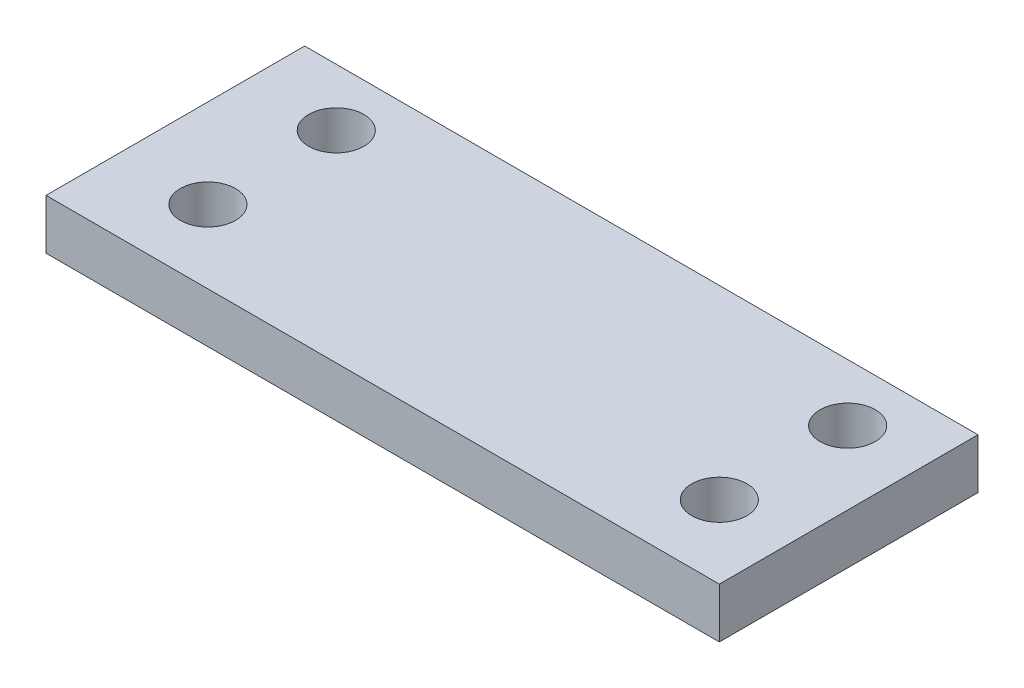
ISO-10303-21;
HEADER;
FILE_DESCRIPTION(('STEP AP214'),'2;1');
FILE_NAME('part.step','',(''),(''),'','','');
FILE_SCHEMA(('AUTOMOTIVE_DESIGN { 1 0 10303 214 1 1 1 1 }'));
ENDSEC;
DATA;
#1=APPLICATION_CONTEXT('core data for automotive mechanical design processes');
#2=APPLICATION_PROTOCOL_DEFINITION('international standard','automotive_design',2000,#1);
#3=PRODUCT_CONTEXT('',#1,'mechanical');
#4=PRODUCT('Part','Part','',(#3));
#5=PRODUCT_RELATED_PRODUCT_CATEGORY('part','',(#4));
#6=PRODUCT_DEFINITION_FORMATION('','',#4);
#7=PRODUCT_DEFINITION_CONTEXT('part definition',#1,'design');
#8=PRODUCT_DEFINITION('design','',#6,#7);
#9=PRODUCT_DEFINITION_SHAPE('','',#8);
#10=(LENGTH_UNIT() NAMED_UNIT(*) SI_UNIT(.MILLI.,.METRE.));
#11=(NAMED_UNIT(*) PLANE_ANGLE_UNIT() SI_UNIT($,.RADIAN.));
#12=(NAMED_UNIT(*) SI_UNIT($,.STERADIAN.) SOLID_ANGLE_UNIT());
#13=UNCERTAINTY_MEASURE_WITH_UNIT(LENGTH_MEASURE(1.E-05),#10,'distance_accuracy_value','');
#14=(GEOMETRIC_REPRESENTATION_CONTEXT(3) GLOBAL_UNCERTAINTY_ASSIGNED_CONTEXT((#13)) GLOBAL_UNIT_ASSIGNED_CONTEXT((#10,
#11,#12)) REPRESENTATION_CONTEXT('',''));
#15=CARTESIAN_POINT('',(0.,0.,0.));
#16=DIRECTION('',(0.,0.,1.));
#17=DIRECTION('',(1.,0.,0.));
#18=AXIS2_PLACEMENT_3D('',#15,#16,#17);
#19=CARTESIAN_POINT('',(0.,10.,0.));
#20=DIRECTION('',(0.,-1.,0.));
#21=DIRECTION('',(0.,0.,-1.));
#22=AXIS2_PLACEMENT_3D('',#19,#20,#21);
#23=PLANE('',#22);
#24=DIRECTION('',(0.,0.,-1.));
#25=VECTOR('',#24,1.);
#26=CARTESIAN_POINT('',(60.6687895874279,10.,-31.7132309207009));
#27=LINE('',#26,#25);
#28=CARTESIAN_POINT('',(60.6687895874279,10.,19.8946355465267));
#29=VERTEX_POINT('',#28);
#30=CARTESIAN_POINT('',(60.6687895874279,10.,-31.7132309207009));
#31=VERTEX_POINT('',#30);
#32=EDGE_CURVE('E87',#29,#31,#27,.T.);
#33=ORIENTED_EDGE('',*,*,#32,.T.);
#34=DIRECTION('',(-1.,0.,0.));
#35=VECTOR('',#34,1.);
#36=CARTESIAN_POINT('',(60.6687895874279,10.,-31.7132309207009));
#37=LINE('',#36,#35);
#38=CARTESIAN_POINT('',(-73.6692444990195,10.,-31.7132309207009));
#39=VERTEX_POINT('',#38);
#40=EDGE_CURVE('E82',#31,#39,#37,.T.);
#41=ORIENTED_EDGE('',*,*,#40,.T.);
#42=DIRECTION('',(0.,0.,1.));
#43=VECTOR('',#42,1.);
#44=CARTESIAN_POINT('',(-73.6692444990195,10.,-31.7132309207009));
#45=LINE('',#44,#43);
#46=CARTESIAN_POINT('',(-73.6692444990195,10.,19.8946355465267));
#47=VERTEX_POINT('',#46);
#48=EDGE_CURVE('E85',#39,#47,#45,.T.);
#49=ORIENTED_EDGE('',*,*,#48,.T.);
#50=DIRECTION('',(1.,0.,0.));
#51=VECTOR('',#50,1.);
#52=CARTESIAN_POINT('',(60.6687895874279,10.,19.8946355465267));
#53=LINE('',#52,#51);
#54=EDGE_CURVE('E52',#47,#29,#53,.T.);
#55=ORIENTED_EDGE('',*,*,#54,.T.);
#56=EDGE_LOOP('',(#33,#41,#49,#55));
#57=FACE_BOUND('',#56,.T.);
#58=CARTESIAN_POINT('',(-55.9413514377581,10.,-20.2885887256658));
#59=DIRECTION('',(0.,1.,0.));
#60=DIRECTION('',(0.,0.,1.));
#61=AXIS2_PLACEMENT_3D('',#58,#59,#60);
#62=CIRCLE('',#61,5.515344507948);
#63=CARTESIAN_POINT('',(-55.9413514377581,10.,-14.7732442177178));
#64=VERTEX_POINT('',#63);
#65=EDGE_CURVE('E102',#64,#64,#62,.T.);
#66=ORIENTED_EDGE('',*,*,#65,.F.);
#67=EDGE_LOOP('',(#66));
#68=FACE_BOUND('',#67,.T.);
#69=CARTESIAN_POINT('',(-55.9413514377581,10.,5.31836791837842));
#70=DIRECTION('',(0.,1.,0.));
#71=DIRECTION('',(0.,0.,1.));
#72=AXIS2_PLACEMENT_3D('',#69,#70,#71);
#73=CIRCLE('',#72,5.515344507948);
#74=CARTESIAN_POINT('',(-55.9413514377581,10.,10.8337124263264));
#75=VERTEX_POINT('',#74);
#76=EDGE_CURVE('E117',#75,#75,#73,.T.);
#77=ORIENTED_EDGE('',*,*,#76,.F.);
#78=EDGE_LOOP('',(#77));
#79=FACE_BOUND('',#78,.T.);
#80=CARTESIAN_POINT('',(46.0925219592797,10.,5.31836791837842));
#81=DIRECTION('',(0.,1.,0.));
#82=DIRECTION('',(0.,0.,1.));
#83=AXIS2_PLACEMENT_3D('',#80,#81,#82);
#84=CIRCLE('',#83,5.515344507948);
#85=CARTESIAN_POINT('',(46.0925219592797,10.,10.8337124263264));
#86=VERTEX_POINT('',#85);
#87=EDGE_CURVE('E123',#86,#86,#84,.T.);
#88=ORIENTED_EDGE('',*,*,#87,.F.);
#89=EDGE_LOOP('',(#88));
#90=FACE_BOUND('',#89,.T.);
#91=CARTESIAN_POINT('',(46.0925219592797,10.,-20.2885887256658));
#92=DIRECTION('',(0.,1.,0.));
#93=DIRECTION('',(0.,0.,1.));
#94=AXIS2_PLACEMENT_3D('',#91,#92,#93);
#95=CIRCLE('',#94,5.515344507948);
#96=CARTESIAN_POINT('',(46.0925219592797,10.,-14.7732442177178));
#97=VERTEX_POINT('',#96);
#98=EDGE_CURVE('E129',#97,#97,#95,.T.);
#99=ORIENTED_EDGE('',*,*,#98,.F.);
#100=EDGE_LOOP('',(#99));
#101=FACE_BOUND('',#100,.T.);
#102=ADVANCED_FACE('F35',(#57,#68,#79,#90,#101),#23,.F.);
#103=CARTESIAN_POINT('',(0.,0.,0.));
#104=DIRECTION('',(0.,-1.,0.));
#105=DIRECTION('',(0.,0.,-1.));
#106=AXIS2_PLACEMENT_3D('',#103,#104,#105);
#107=PLANE('',#106);
#108=CARTESIAN_POINT('',(46.0925219592797,0.,5.31836791837842));
#109=DIRECTION('',(0.,1.,0.));
#110=DIRECTION('',(0.,0.,1.));
#111=AXIS2_PLACEMENT_3D('',#108,#109,#110);
#112=CIRCLE('',#111,5.515344507948);
#113=CARTESIAN_POINT('',(46.0925219592797,0.,10.8337124263264));
#114=VERTEX_POINT('',#113);
#115=EDGE_CURVE('E126',#114,#114,#112,.T.);
#116=ORIENTED_EDGE('',*,*,#115,.T.);
#117=EDGE_LOOP('',(#116));
#118=FACE_BOUND('',#117,.T.);
#119=CARTESIAN_POINT('',(-55.9413514377581,0.,-20.2885887256658));
#120=DIRECTION('',(0.,1.,0.));
#121=DIRECTION('',(0.,0.,1.));
#122=AXIS2_PLACEMENT_3D('',#119,#120,#121);
#123=CIRCLE('',#122,5.515344507948);
#124=CARTESIAN_POINT('',(-55.9413514377581,0.,-14.7732442177178));
#125=VERTEX_POINT('',#124);
#126=EDGE_CURVE('E114',#125,#125,#123,.T.);
#127=ORIENTED_EDGE('',*,*,#126,.T.);
#128=EDGE_LOOP('',(#127));
#129=FACE_BOUND('',#128,.T.);
#130=DIRECTION('',(0.,0.,-1.));
#131=VECTOR('',#130,1.);
#132=CARTESIAN_POINT('',(60.6687895874279,0.,-31.7132309207009));
#133=LINE('',#132,#131);
#134=CARTESIAN_POINT('',(60.6687895874279,0.,19.8946355465267));
#135=VERTEX_POINT('',#134);
#136=CARTESIAN_POINT('',(60.6687895874279,0.,-31.7132309207009));
#137=VERTEX_POINT('',#136);
#138=EDGE_CURVE('E99',#135,#137,#133,.T.);
#139=ORIENTED_EDGE('',*,*,#138,.F.);
#140=DIRECTION('',(1.,0.,0.));
#141=VECTOR('',#140,1.);
#142=CARTESIAN_POINT('',(60.6687895874279,0.,19.8946355465267));
#143=LINE('',#142,#141);
#144=CARTESIAN_POINT('',(-73.6692444990195,0.,19.8946355465267));
#145=VERTEX_POINT('',#144);
#146=EDGE_CURVE('E75',#145,#135,#143,.T.);
#147=ORIENTED_EDGE('',*,*,#146,.F.);
#148=DIRECTION('',(0.,0.,1.));
#149=VECTOR('',#148,1.);
#150=CARTESIAN_POINT('',(-73.6692444990195,0.,-31.7132309207009));
#151=LINE('',#150,#149);
#152=CARTESIAN_POINT('',(-73.6692444990195,0.,-31.7132309207009));
#153=VERTEX_POINT('',#152);
#154=EDGE_CURVE('E69',#153,#145,#151,.T.);
#155=ORIENTED_EDGE('',*,*,#154,.F.);
#156=DIRECTION('',(-1.,0.,0.));
#157=VECTOR('',#156,1.);
#158=CARTESIAN_POINT('',(60.6687895874279,0.,-31.7132309207009));
#159=LINE('',#158,#157);
#160=EDGE_CURVE('E91',#137,#153,#159,.T.);
#161=ORIENTED_EDGE('',*,*,#160,.F.);
#162=EDGE_LOOP('',(#139,#147,#155,#161));
#163=FACE_BOUND('',#162,.T.);
#164=CARTESIAN_POINT('',(-55.9413514377581,0.,5.31836791837842));
#165=DIRECTION('',(0.,1.,0.));
#166=DIRECTION('',(0.,0.,1.));
#167=AXIS2_PLACEMENT_3D('',#164,#165,#166);
#168=CIRCLE('',#167,5.515344507948);
#169=CARTESIAN_POINT('',(-55.9413514377581,0.,10.8337124263264));
#170=VERTEX_POINT('',#169);
#171=EDGE_CURVE('E120',#170,#170,#168,.T.);
#172=ORIENTED_EDGE('',*,*,#171,.T.);
#173=EDGE_LOOP('',(#172));
#174=FACE_BOUND('',#173,.T.);
#175=CARTESIAN_POINT('',(46.0925219592797,0.,-20.2885887256658));
#176=DIRECTION('',(0.,1.,0.));
#177=DIRECTION('',(0.,0.,1.));
#178=AXIS2_PLACEMENT_3D('',#175,#176,#177);
#179=CIRCLE('',#178,5.515344507948);
#180=CARTESIAN_POINT('',(46.0925219592797,0.,-14.7732442177178));
#181=VERTEX_POINT('',#180);
#182=EDGE_CURVE('E132',#181,#181,#179,.T.);
#183=ORIENTED_EDGE('',*,*,#182,.T.);
#184=EDGE_LOOP('',(#183));
#185=FACE_BOUND('',#184,.T.);
#186=ADVANCED_FACE('F110',(#118,#129,#163,#174,#185),#107,.T.);
#187=CARTESIAN_POINT('',(60.6687895874279,10.,-31.7132309207009));
#188=DIRECTION('',(-1.,0.,0.));
#189=DIRECTION('',(0.,0.,1.));
#190=AXIS2_PLACEMENT_3D('',#187,#188,#189);
#191=PLANE('',#190);
#192=ORIENTED_EDGE('',*,*,#138,.T.);
#193=DIRECTION('',(0.,-1.,0.));
#194=VECTOR('',#193,1.);
#195=CARTESIAN_POINT('',(60.6687895874279,10.,-31.7132309207009));
#196=LINE('',#195,#194);
#197=EDGE_CURVE('E11',#31,#137,#196,.T.);
#198=ORIENTED_EDGE('',*,*,#197,.F.);
#199=ORIENTED_EDGE('',*,*,#32,.F.);
#200=DIRECTION('',(0.,-1.,0.));
#201=VECTOR('',#200,1.);
#202=CARTESIAN_POINT('',(60.6687895874279,10.,19.8946355465267));
#203=LINE('',#202,#201);
#204=EDGE_CURVE('E95',#29,#135,#203,.T.);
#205=ORIENTED_EDGE('',*,*,#204,.T.);
#206=EDGE_LOOP('',(#192,#198,#199,#205));
#207=FACE_BOUND('',#206,.T.);
#208=ADVANCED_FACE('F37',(#207),#191,.F.);
#209=CARTESIAN_POINT('',(60.6687895874279,10.,-31.7132309207009));
#210=DIRECTION('',(0.,0.,1.));
#211=DIRECTION('',(1.,0.,0.));
#212=AXIS2_PLACEMENT_3D('',#209,#210,#211);
#213=PLANE('',#212);
#214=ORIENTED_EDGE('',*,*,#160,.T.);
#215=DIRECTION('',(0.,-1.,0.));
#216=VECTOR('',#215,1.);
#217=CARTESIAN_POINT('',(-73.6692444990195,10.,-31.7132309207009));
#218=LINE('',#217,#216);
#219=EDGE_CURVE('E44',#39,#153,#218,.T.);
#220=ORIENTED_EDGE('',*,*,#219,.F.);
#221=ORIENTED_EDGE('',*,*,#40,.F.);
#222=ORIENTED_EDGE('',*,*,#197,.T.);
#223=EDGE_LOOP('',(#214,#220,#221,#222));
#224=FACE_BOUND('',#223,.T.);
#225=ADVANCED_FACE('F90',(#224),#213,.F.);
#226=CARTESIAN_POINT('',(-73.6692444990195,10.,-31.7132309207009));
#227=DIRECTION('',(1.,0.,0.));
#228=DIRECTION('',(0.,0.,-1.));
#229=AXIS2_PLACEMENT_3D('',#226,#227,#228);
#230=PLANE('',#229);
#231=ORIENTED_EDGE('',*,*,#154,.T.);
#232=DIRECTION('',(0.,-1.,0.));
#233=VECTOR('',#232,1.);
#234=CARTESIAN_POINT('',(-73.6692444990195,10.,19.8946355465267));
#235=LINE('',#234,#233);
#236=EDGE_CURVE('E92',#47,#145,#235,.T.);
#237=ORIENTED_EDGE('',*,*,#236,.F.);
#238=ORIENTED_EDGE('',*,*,#48,.F.);
#239=ORIENTED_EDGE('',*,*,#219,.T.);
#240=EDGE_LOOP('',(#231,#237,#238,#239));
#241=FACE_BOUND('',#240,.T.);
#242=ADVANCED_FACE('F93',(#241),#230,.F.);
#243=CARTESIAN_POINT('',(60.6687895874279,10.,19.8946355465267));
#244=DIRECTION('',(0.,0.,-1.));
#245=DIRECTION('',(-1.,0.,0.));
#246=AXIS2_PLACEMENT_3D('',#243,#244,#245);
#247=PLANE('',#246);
#248=ORIENTED_EDGE('',*,*,#146,.T.);
#249=ORIENTED_EDGE('',*,*,#204,.F.);
#250=ORIENTED_EDGE('',*,*,#54,.F.);
#251=ORIENTED_EDGE('',*,*,#236,.T.);
#252=EDGE_LOOP('',(#248,#249,#250,#251));
#253=FACE_BOUND('',#252,.T.);
#254=ADVANCED_FACE('F107',(#253),#247,.F.);
#255=CARTESIAN_POINT('',(-55.9413514377581,10.,-20.2885887256658));
#256=DIRECTION('',(0.,-1.,0.));
#257=DIRECTION('',(0.,0.,-1.));
#258=AXIS2_PLACEMENT_3D('',#255,#256,#257);
#259=CYLINDRICAL_SURFACE('',#258,5.515344507948);
#260=ORIENTED_EDGE('',*,*,#65,.T.);
#261=EDGE_LOOP('',(#260));
#262=FACE_BOUND('',#261,.T.);
#263=ORIENTED_EDGE('',*,*,#126,.F.);
#264=EDGE_LOOP('',(#263));
#265=FACE_BOUND('',#264,.T.);
#266=ADVANCED_FACE('F149',(#262,#265),#259,.F.);
#267=CARTESIAN_POINT('',(-55.9413514377581,10.,5.31836791837842));
#268=DIRECTION('',(0.,-1.,0.));
#269=DIRECTION('',(0.,0.,-1.));
#270=AXIS2_PLACEMENT_3D('',#267,#268,#269);
#271=CYLINDRICAL_SURFACE('',#270,5.515344507948);
#272=ORIENTED_EDGE('',*,*,#76,.T.);
#273=EDGE_LOOP('',(#272));
#274=FACE_BOUND('',#273,.T.);
#275=ORIENTED_EDGE('',*,*,#171,.F.);
#276=EDGE_LOOP('',(#275));
#277=FACE_BOUND('',#276,.T.);
#278=ADVANCED_FACE('F195',(#274,#277),#271,.F.);
#279=CARTESIAN_POINT('',(46.0925219592797,10.,5.31836791837842));
#280=DIRECTION('',(0.,-1.,0.));
#281=DIRECTION('',(0.,0.,-1.));
#282=AXIS2_PLACEMENT_3D('',#279,#280,#281);
#283=CYLINDRICAL_SURFACE('',#282,5.515344507948);
#284=ORIENTED_EDGE('',*,*,#87,.T.);
#285=EDGE_LOOP('',(#284));
#286=FACE_BOUND('',#285,.T.);
#287=ORIENTED_EDGE('',*,*,#115,.F.);
#288=EDGE_LOOP('',(#287));
#289=FACE_BOUND('',#288,.T.);
#290=ADVANCED_FACE('F203',(#286,#289),#283,.F.);
#291=CARTESIAN_POINT('',(46.0925219592797,10.,-20.2885887256658));
#292=DIRECTION('',(0.,-1.,0.));
#293=DIRECTION('',(0.,0.,-1.));
#294=AXIS2_PLACEMENT_3D('',#291,#292,#293);
#295=CYLINDRICAL_SURFACE('',#294,5.515344507948);
#296=ORIENTED_EDGE('',*,*,#98,.T.);
#297=EDGE_LOOP('',(#296));
#298=FACE_BOUND('',#297,.T.);
#299=ORIENTED_EDGE('',*,*,#182,.F.);
#300=EDGE_LOOP('',(#299));
#301=FACE_BOUND('',#300,.T.);
#302=ADVANCED_FACE('F138',(#298,#301),#295,.F.);
#303=CLOSED_SHELL('',(#102,#186,#208,#225,#242,#254,#266,#278,#290,#302));
#304=MANIFOLD_SOLID_BREP('B2',#303);
#305=ADVANCED_BREP_SHAPE_REPRESENTATION('',(#18,#304),#14);
#306=SHAPE_DEFINITION_REPRESENTATION(#9,#305);
ENDSEC;
END-ISO-10303-21;
